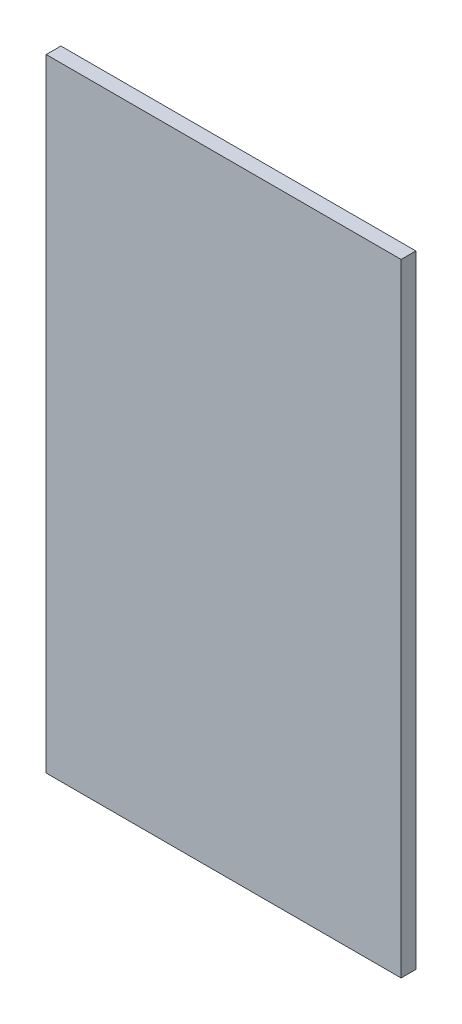
ISO-10303-21;
HEADER;
FILE_DESCRIPTION(('STEP AP214'),'2;1');
FILE_NAME('part.step','',(''),(''),'','','');
FILE_SCHEMA(('AUTOMOTIVE_DESIGN { 1 0 10303 214 1 1 1 1 }'));
ENDSEC;
DATA;
#1=APPLICATION_CONTEXT('core data for automotive mechanical design processes');
#2=APPLICATION_PROTOCOL_DEFINITION('international standard','automotive_design',2000,#1);
#3=PRODUCT_CONTEXT('',#1,'mechanical');
#4=PRODUCT('Part','Part','',(#3));
#5=PRODUCT_RELATED_PRODUCT_CATEGORY('part','',(#4));
#6=PRODUCT_DEFINITION_FORMATION('','',#4);
#7=PRODUCT_DEFINITION_CONTEXT('part definition',#1,'design');
#8=PRODUCT_DEFINITION('design','',#6,#7);
#9=PRODUCT_DEFINITION_SHAPE('','',#8);
#10=(LENGTH_UNIT() NAMED_UNIT(*) SI_UNIT(.MILLI.,.METRE.));
#11=(NAMED_UNIT(*) PLANE_ANGLE_UNIT() SI_UNIT($,.RADIAN.));
#12=(NAMED_UNIT(*) SI_UNIT($,.STERADIAN.) SOLID_ANGLE_UNIT());
#13=UNCERTAINTY_MEASURE_WITH_UNIT(LENGTH_MEASURE(1.E-05),#10,'distance_accuracy_value','');
#14=(GEOMETRIC_REPRESENTATION_CONTEXT(3) GLOBAL_UNCERTAINTY_ASSIGNED_CONTEXT((#13)) GLOBAL_UNIT_ASSIGNED_CONTEXT((#10,
#11,#12)) REPRESENTATION_CONTEXT('',''));
#15=CARTESIAN_POINT('',(0.,0.,0.));
#16=DIRECTION('',(0.,0.,1.));
#17=DIRECTION('',(1.,0.,0.));
#18=AXIS2_PLACEMENT_3D('',#15,#16,#17);
#19=CARTESIAN_POINT('',(-216.75,-380.,18.));
#20=DIRECTION('',(1.,0.,0.));
#21=DIRECTION('',(0.,0.,-1.));
#22=AXIS2_PLACEMENT_3D('',#19,#20,#21);
#23=PLANE('',#22);
#24=DIRECTION('',(0.,-1.,0.));
#25=VECTOR('',#24,1.);
#26=CARTESIAN_POINT('',(-216.75,-380.,0.));
#27=LINE('',#26,#25);
#28=CARTESIAN_POINT('',(-216.75,380.,0.));
#29=VERTEX_POINT('',#28);
#30=CARTESIAN_POINT('',(-216.75,-380.,0.));
#31=VERTEX_POINT('',#30);
#32=EDGE_CURVE('E96',#29,#31,#27,.T.);
#33=ORIENTED_EDGE('',*,*,#32,.T.);
#34=DIRECTION('',(0.,0.,-1.));
#35=VECTOR('',#34,1.);
#36=CARTESIAN_POINT('',(-216.75,-380.,18.));
#37=LINE('',#36,#35);
#38=CARTESIAN_POINT('',(-216.75,-380.,18.));
#39=VERTEX_POINT('',#38);
#40=EDGE_CURVE('E11',#39,#31,#37,.T.);
#41=ORIENTED_EDGE('',*,*,#40,.F.);
#42=DIRECTION('',(0.,-1.,0.));
#43=VECTOR('',#42,1.);
#44=CARTESIAN_POINT('',(-216.75,-380.,18.));
#45=LINE('',#44,#43);
#46=CARTESIAN_POINT('',(-216.75,380.,18.));
#47=VERTEX_POINT('',#46);
#48=EDGE_CURVE('E84',#47,#39,#45,.T.);
#49=ORIENTED_EDGE('',*,*,#48,.F.);
#50=DIRECTION('',(0.,0.,-1.));
#51=VECTOR('',#50,1.);
#52=CARTESIAN_POINT('',(-216.75,380.,18.));
#53=LINE('',#52,#51);
#54=EDGE_CURVE('E92',#47,#29,#53,.T.);
#55=ORIENTED_EDGE('',*,*,#54,.T.);
#56=EDGE_LOOP('',(#33,#41,#49,#55));
#57=FACE_BOUND('',#56,.T.);
#58=ADVANCED_FACE('F33',(#57),#23,.F.);
#59=CARTESIAN_POINT('',(216.75,-380.,18.));
#60=DIRECTION('',(0.,1.,0.));
#61=DIRECTION('',(0.,0.,1.));
#62=AXIS2_PLACEMENT_3D('',#59,#60,#61);
#63=PLANE('',#62);
#64=DIRECTION('',(1.,0.,0.));
#65=VECTOR('',#64,1.);
#66=CARTESIAN_POINT('',(216.75,-380.,0.));
#67=LINE('',#66,#65);
#68=CARTESIAN_POINT('',(216.75,-380.,0.));
#69=VERTEX_POINT('',#68);
#70=EDGE_CURVE('E88',#31,#69,#67,.T.);
#71=ORIENTED_EDGE('',*,*,#70,.T.);
#72=DIRECTION('',(0.,0.,-1.));
#73=VECTOR('',#72,1.);
#74=CARTESIAN_POINT('',(216.75,-380.,18.));
#75=LINE('',#74,#73);
#76=CARTESIAN_POINT('',(216.75,-380.,18.));
#77=VERTEX_POINT('',#76);
#78=EDGE_CURVE('E41',#77,#69,#75,.T.);
#79=ORIENTED_EDGE('',*,*,#78,.F.);
#80=DIRECTION('',(1.,0.,0.));
#81=VECTOR('',#80,1.);
#82=CARTESIAN_POINT('',(216.75,-380.,18.));
#83=LINE('',#82,#81);
#84=EDGE_CURVE('E79',#39,#77,#83,.T.);
#85=ORIENTED_EDGE('',*,*,#84,.F.);
#86=ORIENTED_EDGE('',*,*,#40,.T.);
#87=EDGE_LOOP('',(#71,#79,#85,#86));
#88=FACE_BOUND('',#87,.T.);
#89=ADVANCED_FACE('F87',(#88),#63,.F.);
#90=CARTESIAN_POINT('',(216.75,-380.,18.));
#91=DIRECTION('',(-1.,0.,0.));
#92=DIRECTION('',(0.,0.,1.));
#93=AXIS2_PLACEMENT_3D('',#90,#91,#92);
#94=PLANE('',#93);
#95=DIRECTION('',(0.,1.,0.));
#96=VECTOR('',#95,1.);
#97=CARTESIAN_POINT('',(216.75,-380.,0.));
#98=LINE('',#97,#96);
#99=CARTESIAN_POINT('',(216.75,380.,0.));
#100=VERTEX_POINT('',#99);
#101=EDGE_CURVE('E66',#69,#100,#98,.T.);
#102=ORIENTED_EDGE('',*,*,#101,.T.);
#103=DIRECTION('',(0.,0.,-1.));
#104=VECTOR('',#103,1.);
#105=CARTESIAN_POINT('',(216.75,380.,18.));
#106=LINE('',#105,#104);
#107=CARTESIAN_POINT('',(216.75,380.,18.));
#108=VERTEX_POINT('',#107);
#109=EDGE_CURVE('E89',#108,#100,#106,.T.);
#110=ORIENTED_EDGE('',*,*,#109,.F.);
#111=DIRECTION('',(0.,1.,0.));
#112=VECTOR('',#111,1.);
#113=CARTESIAN_POINT('',(216.75,-380.,18.));
#114=LINE('',#113,#112);
#115=EDGE_CURVE('E82',#77,#108,#114,.T.);
#116=ORIENTED_EDGE('',*,*,#115,.F.);
#117=ORIENTED_EDGE('',*,*,#78,.T.);
#118=EDGE_LOOP('',(#102,#110,#116,#117));
#119=FACE_BOUND('',#118,.T.);
#120=ADVANCED_FACE('F90',(#119),#94,.F.);
#121=CARTESIAN_POINT('',(216.75,380.,18.));
#122=DIRECTION('',(0.,-1.,0.));
#123=DIRECTION('',(1.,0.,0.));
#124=AXIS2_PLACEMENT_3D('',#121,#122,#123);
#125=PLANE('',#124);
#126=DIRECTION('',(-1.,0.,0.));
#127=VECTOR('',#126,1.);
#128=CARTESIAN_POINT('',(216.75,380.,0.));
#129=LINE('',#128,#127);
#130=EDGE_CURVE('E72',#100,#29,#129,.T.);
#131=ORIENTED_EDGE('',*,*,#130,.T.);
#132=ORIENTED_EDGE('',*,*,#54,.F.);
#133=DIRECTION('',(-1.,0.,0.));
#134=VECTOR('',#133,1.);
#135=CARTESIAN_POINT('',(216.75,380.,18.));
#136=LINE('',#135,#134);
#137=EDGE_CURVE('E49',#108,#47,#136,.T.);
#138=ORIENTED_EDGE('',*,*,#137,.F.);
#139=ORIENTED_EDGE('',*,*,#109,.T.);
#140=EDGE_LOOP('',(#131,#132,#138,#139));
#141=FACE_BOUND('',#140,.T.);
#142=ADVANCED_FACE('F103',(#141),#125,.F.);
#143=CARTESIAN_POINT('',(0.,0.,18.));
#144=DIRECTION('',(0.,0.,1.));
#145=DIRECTION('',(1.,0.,0.));
#146=AXIS2_PLACEMENT_3D('',#143,#144,#145);
#147=PLANE('',#146);
#148=ORIENTED_EDGE('',*,*,#48,.T.);
#149=ORIENTED_EDGE('',*,*,#84,.T.);
#150=ORIENTED_EDGE('',*,*,#115,.T.);
#151=ORIENTED_EDGE('',*,*,#137,.T.);
#152=EDGE_LOOP('',(#148,#149,#150,#151));
#153=FACE_BOUND('',#152,.T.);
#154=ADVANCED_FACE('F80',(#153),#147,.T.);
#155=CARTESIAN_POINT('',(0.,0.,0.));
#156=DIRECTION('',(0.,0.,1.));
#157=DIRECTION('',(1.,0.,0.));
#158=AXIS2_PLACEMENT_3D('',#155,#156,#157);
#159=PLANE('',#158);
#160=ORIENTED_EDGE('',*,*,#32,.F.);
#161=ORIENTED_EDGE('',*,*,#130,.F.);
#162=ORIENTED_EDGE('',*,*,#101,.F.);
#163=ORIENTED_EDGE('',*,*,#70,.F.);
#164=EDGE_LOOP('',(#160,#161,#162,#163));
#165=FACE_BOUND('',#164,.T.);
#166=ADVANCED_FACE('F106',(#165),#159,.F.);
#167=CLOSED_SHELL('',(#58,#89,#120,#142,#154,#166));
#168=MANIFOLD_SOLID_BREP('B2',#167);
#169=ADVANCED_BREP_SHAPE_REPRESENTATION('',(#18,#168),#14);
#170=SHAPE_DEFINITION_REPRESENTATION(#9,#169);
ENDSEC;
END-ISO-10303-21;
